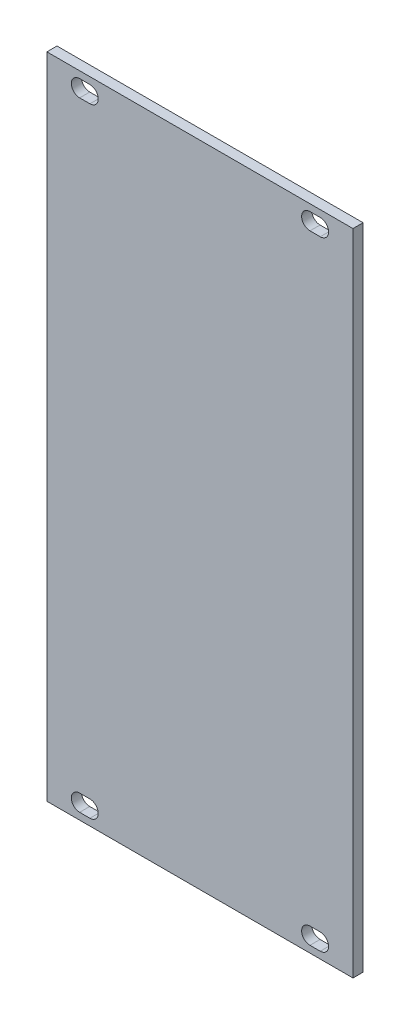
ISO-10303-21;
HEADER;
FILE_DESCRIPTION(('STEP AP214'),'2;1');
FILE_NAME('part.step','',(''),(''),'','','');
FILE_SCHEMA(('AUTOMOTIVE_DESIGN { 1 0 10303 214 1 1 1 1 }'));
ENDSEC;
DATA;
#1=APPLICATION_CONTEXT('core data for automotive mechanical design processes');
#2=APPLICATION_PROTOCOL_DEFINITION('international standard','automotive_design',2000,#1);
#3=PRODUCT_CONTEXT('',#1,'mechanical');
#4=PRODUCT('Part','Part','',(#3));
#5=PRODUCT_RELATED_PRODUCT_CATEGORY('part','',(#4));
#6=PRODUCT_DEFINITION_FORMATION('','',#4);
#7=PRODUCT_DEFINITION_CONTEXT('part definition',#1,'design');
#8=PRODUCT_DEFINITION('design','',#6,#7);
#9=PRODUCT_DEFINITION_SHAPE('','',#8);
#10=(LENGTH_UNIT() NAMED_UNIT(*) SI_UNIT(.MILLI.,.METRE.));
#11=(NAMED_UNIT(*) PLANE_ANGLE_UNIT() SI_UNIT($,.RADIAN.));
#12=(NAMED_UNIT(*) SI_UNIT($,.STERADIAN.) SOLID_ANGLE_UNIT());
#13=UNCERTAINTY_MEASURE_WITH_UNIT(LENGTH_MEASURE(1.E-05),#10,'distance_accuracy_value','');
#14=(GEOMETRIC_REPRESENTATION_CONTEXT(3) GLOBAL_UNCERTAINTY_ASSIGNED_CONTEXT((#13)) GLOBAL_UNIT_ASSIGNED_CONTEXT((#10,
#11,#12)) REPRESENTATION_CONTEXT('',''));
#15=CARTESIAN_POINT('',(0.,0.,0.));
#16=DIRECTION('',(0.,0.,1.));
#17=DIRECTION('',(1.,0.,0.));
#18=AXIS2_PLACEMENT_3D('',#15,#16,#17);
#19=CARTESIAN_POINT('',(0.,0.,2.));
#20=DIRECTION('',(0.,0.,1.));
#21=DIRECTION('',(1.,0.,0.));
#22=AXIS2_PLACEMENT_3D('',#19,#20,#21);
#23=PLANE('',#22);
#24=DIRECTION('',(0.,1.,0.));
#25=VECTOR('',#24,1.);
#26=CARTESIAN_POINT('',(30.3,64.25,2.));
#27=LINE('',#26,#25);
#28=CARTESIAN_POINT('',(30.3,-64.25,2.));
#29=VERTEX_POINT('',#28);
#30=CARTESIAN_POINT('',(30.3,64.25,2.));
#31=VERTEX_POINT('',#30);
#32=EDGE_CURVE('E360',#29,#31,#27,.T.);
#33=ORIENTED_EDGE('',*,*,#32,.T.);
#34=DIRECTION('',(-1.,0.,0.));
#35=VECTOR('',#34,1.);
#36=CARTESIAN_POINT('',(-30.3,64.25,2.));
#37=LINE('',#36,#35);
#38=CARTESIAN_POINT('',(-30.3,64.25,2.));
#39=VERTEX_POINT('',#38);
#40=EDGE_CURVE('E364',#31,#39,#37,.T.);
#41=ORIENTED_EDGE('',*,*,#40,.T.);
#42=DIRECTION('',(0.,-1.,0.));
#43=VECTOR('',#42,1.);
#44=CARTESIAN_POINT('',(-30.3,64.25,2.));
#45=LINE('',#44,#43);
#46=CARTESIAN_POINT('',(-30.3,-64.25,2.));
#47=VERTEX_POINT('',#46);
#48=EDGE_CURVE('E368',#39,#47,#45,.T.);
#49=ORIENTED_EDGE('',*,*,#48,.T.);
#50=DIRECTION('',(1.,0.,0.));
#51=VECTOR('',#50,1.);
#52=CARTESIAN_POINT('',(-30.3,-64.25,2.));
#53=LINE('',#52,#51);
#54=EDGE_CURVE('E371',#47,#29,#53,.T.);
#55=ORIENTED_EDGE('',*,*,#54,.T.);
#56=EDGE_LOOP('',(#33,#41,#49,#55));
#57=FACE_BOUND('',#56,.T.);
#58=DIRECTION('',(1.,0.,0.));
#59=VECTOR('',#58,1.);
#60=CARTESIAN_POINT('',(-23.816,-62.9,2.));
#61=LINE('',#60,#59);
#62=CARTESIAN_POINT('',(-23.816,-62.9,2.));
#63=VERTEX_POINT('',#62);
#64=CARTESIAN_POINT('',(-21.784,-62.9,2.));
#65=VERTEX_POINT('',#64);
#66=EDGE_CURVE('E320',#63,#65,#61,.T.);
#67=ORIENTED_EDGE('',*,*,#66,.F.);
#68=CARTESIAN_POINT('',(-23.816,-61.25,2.));
#69=DIRECTION('',(0.,0.,1.));
#70=DIRECTION('',(1.,0.,0.));
#71=AXIS2_PLACEMENT_3D('',#68,#69,#70);
#72=CIRCLE('',#71,1.65);
#73=CARTESIAN_POINT('',(-23.816,-59.6,2.));
#74=VERTEX_POINT('',#73);
#75=EDGE_CURVE('E317',#74,#63,#72,.T.);
#76=ORIENTED_EDGE('',*,*,#75,.F.);
#77=DIRECTION('',(-1.,0.,0.));
#78=VECTOR('',#77,1.);
#79=CARTESIAN_POINT('',(-23.816,-59.6,2.));
#80=LINE('',#79,#78);
#81=CARTESIAN_POINT('',(-21.784,-59.6,2.));
#82=VERTEX_POINT('',#81);
#83=EDGE_CURVE('E328',#82,#74,#80,.T.);
#84=ORIENTED_EDGE('',*,*,#83,.F.);
#85=CARTESIAN_POINT('',(-21.784,-61.25,2.));
#86=DIRECTION('',(0.,0.,1.));
#87=DIRECTION('',(1.,0.,0.));
#88=AXIS2_PLACEMENT_3D('',#85,#86,#87);
#89=CIRCLE('',#88,1.65);
#90=EDGE_CURVE('E324',#65,#82,#89,.T.);
#91=ORIENTED_EDGE('',*,*,#90,.F.);
#92=EDGE_LOOP('',(#67,#76,#84,#91));
#93=FACE_BOUND('',#92,.T.);
#94=DIRECTION('',(1.,0.,0.));
#95=VECTOR('',#94,1.);
#96=CARTESIAN_POINT('',(21.784000014,59.6,2.));
#97=LINE('',#96,#95);
#98=CARTESIAN_POINT('',(21.784000014,59.6,2.));
#99=VERTEX_POINT('',#98);
#100=CARTESIAN_POINT('',(23.816000014,59.6,2.));
#101=VERTEX_POINT('',#100);
#102=EDGE_CURVE('E277',#99,#101,#97,.T.);
#103=ORIENTED_EDGE('',*,*,#102,.F.);
#104=CARTESIAN_POINT('',(21.784000014,61.25,2.));
#105=DIRECTION('',(0.,0.,1.));
#106=DIRECTION('',(1.,0.,0.));
#107=AXIS2_PLACEMENT_3D('',#104,#105,#106);
#108=CIRCLE('',#107,1.65000000000001);
#109=CARTESIAN_POINT('',(21.784000014,62.9,2.));
#110=VERTEX_POINT('',#109);
#111=EDGE_CURVE('E274',#110,#99,#108,.T.);
#112=ORIENTED_EDGE('',*,*,#111,.F.);
#113=DIRECTION('',(-1.,0.,0.));
#114=VECTOR('',#113,1.);
#115=CARTESIAN_POINT('',(21.784000014,62.9,2.));
#116=LINE('',#115,#114);
#117=CARTESIAN_POINT('',(23.816000014,62.9,2.));
#118=VERTEX_POINT('',#117);
#119=EDGE_CURVE('E285',#118,#110,#116,.T.);
#120=ORIENTED_EDGE('',*,*,#119,.F.);
#121=CARTESIAN_POINT('',(23.816000014,61.25,2.));
#122=DIRECTION('',(0.,0.,1.));
#123=DIRECTION('',(1.,0.,0.));
#124=AXIS2_PLACEMENT_3D('',#121,#122,#123);
#125=CIRCLE('',#124,1.65000000000001);
#126=EDGE_CURVE('E281',#101,#118,#125,.T.);
#127=ORIENTED_EDGE('',*,*,#126,.F.);
#128=EDGE_LOOP('',(#103,#112,#120,#127));
#129=FACE_BOUND('',#128,.T.);
#130=DIRECTION('',(1.,0.,0.));
#131=VECTOR('',#130,1.);
#132=CARTESIAN_POINT('',(-23.816,59.6,2.));
#133=LINE('',#132,#131);
#134=CARTESIAN_POINT('',(-23.816,59.6,2.));
#135=VERTEX_POINT('',#134);
#136=CARTESIAN_POINT('',(-21.784,59.6,2.));
#137=VERTEX_POINT('',#136);
#138=EDGE_CURVE('E234',#135,#137,#133,.T.);
#139=ORIENTED_EDGE('',*,*,#138,.F.);
#140=CARTESIAN_POINT('',(-23.816,61.25,2.));
#141=DIRECTION('',(0.,0.,1.));
#142=DIRECTION('',(1.,0.,0.));
#143=AXIS2_PLACEMENT_3D('',#140,#141,#142);
#144=CIRCLE('',#143,1.64999999999999);
#145=CARTESIAN_POINT('',(-23.816,62.9,2.));
#146=VERTEX_POINT('',#145);
#147=EDGE_CURVE('E231',#146,#135,#144,.T.);
#148=ORIENTED_EDGE('',*,*,#147,.F.);
#149=DIRECTION('',(-1.,0.,0.));
#150=VECTOR('',#149,1.);
#151=CARTESIAN_POINT('',(-23.816,62.9,2.));
#152=LINE('',#151,#150);
#153=CARTESIAN_POINT('',(-21.784,62.9,2.));
#154=VERTEX_POINT('',#153);
#155=EDGE_CURVE('E242',#154,#146,#152,.T.);
#156=ORIENTED_EDGE('',*,*,#155,.F.);
#157=CARTESIAN_POINT('',(-21.784,61.25,2.));
#158=DIRECTION('',(0.,0.,1.));
#159=DIRECTION('',(1.,0.,0.));
#160=AXIS2_PLACEMENT_3D('',#157,#158,#159);
#161=CIRCLE('',#160,1.64999999999999);
#162=EDGE_CURVE('E238',#137,#154,#161,.T.);
#163=ORIENTED_EDGE('',*,*,#162,.F.);
#164=EDGE_LOOP('',(#139,#148,#156,#163));
#165=FACE_BOUND('',#164,.T.);
#166=DIRECTION('',(1.,0.,0.));
#167=VECTOR('',#166,1.);
#168=CARTESIAN_POINT('',(21.784000014,-62.9,2.));
#169=LINE('',#168,#167);
#170=CARTESIAN_POINT('',(21.784000014,-62.9,2.));
#171=VERTEX_POINT('',#170);
#172=CARTESIAN_POINT('',(23.816000014,-62.9,2.));
#173=VERTEX_POINT('',#172);
#174=EDGE_CURVE('E192',#171,#173,#169,.T.);
#175=ORIENTED_EDGE('',*,*,#174,.F.);
#176=CARTESIAN_POINT('',(21.784000014,-61.25,2.));
#177=DIRECTION('',(0.,0.,1.));
#178=DIRECTION('',(1.,0.,0.));
#179=AXIS2_PLACEMENT_3D('',#176,#177,#178);
#180=CIRCLE('',#179,1.65);
#181=CARTESIAN_POINT('',(21.784000014,-59.6,2.));
#182=VERTEX_POINT('',#181);
#183=EDGE_CURVE('E183',#182,#171,#180,.T.);
#184=ORIENTED_EDGE('',*,*,#183,.F.);
#185=DIRECTION('',(-1.,0.,0.));
#186=VECTOR('',#185,1.);
#187=CARTESIAN_POINT('',(21.784000014,-59.6,2.));
#188=LINE('',#187,#186);
#189=CARTESIAN_POINT('',(23.816000014,-59.6,2.));
#190=VERTEX_POINT('',#189);
#191=EDGE_CURVE('E209',#190,#182,#188,.T.);
#192=ORIENTED_EDGE('',*,*,#191,.F.);
#193=CARTESIAN_POINT('',(23.816000014,-61.25,2.));
#194=DIRECTION('',(0.,0.,1.));
#195=DIRECTION('',(1.,0.,0.));
#196=AXIS2_PLACEMENT_3D('',#193,#194,#195);
#197=CIRCLE('',#196,1.65);
#198=EDGE_CURVE('E205',#173,#190,#197,.T.);
#199=ORIENTED_EDGE('',*,*,#198,.F.);
#200=EDGE_LOOP('',(#175,#184,#192,#199));
#201=FACE_BOUND('',#200,.T.);
#202=ADVANCED_FACE('F45',(#57,#93,#129,#165,#201),#23,.T.);
#203=CARTESIAN_POINT('',(0.,0.,0.));
#204=DIRECTION('',(0.,0.,1.));
#205=DIRECTION('',(1.,0.,0.));
#206=AXIS2_PLACEMENT_3D('',#203,#204,#205);
#207=PLANE('',#206);
#208=CARTESIAN_POINT('',(-23.816,61.25,0.));
#209=DIRECTION('',(0.,0.,1.));
#210=DIRECTION('',(1.,0.,0.));
#211=AXIS2_PLACEMENT_3D('',#208,#209,#210);
#212=CIRCLE('',#211,1.64999999999999);
#213=CARTESIAN_POINT('',(-23.816,62.9,0.));
#214=VERTEX_POINT('',#213);
#215=CARTESIAN_POINT('',(-23.816,59.6,0.));
#216=VERTEX_POINT('',#215);
#217=EDGE_CURVE('E201',#214,#216,#212,.T.);
#218=ORIENTED_EDGE('',*,*,#217,.T.);
#219=DIRECTION('',(1.,0.,0.));
#220=VECTOR('',#219,1.);
#221=CARTESIAN_POINT('',(-23.816,59.6,0.));
#222=LINE('',#221,#220);
#223=CARTESIAN_POINT('',(-21.784,59.6,0.));
#224=VERTEX_POINT('',#223);
#225=EDGE_CURVE('E249',#216,#224,#222,.T.);
#226=ORIENTED_EDGE('',*,*,#225,.T.);
#227=CARTESIAN_POINT('',(-21.784,61.25,0.));
#228=DIRECTION('',(0.,0.,1.));
#229=DIRECTION('',(1.,0.,0.));
#230=AXIS2_PLACEMENT_3D('',#227,#228,#229);
#231=CIRCLE('',#230,1.64999999999999);
#232=CARTESIAN_POINT('',(-21.784,62.9,0.));
#233=VERTEX_POINT('',#232);
#234=EDGE_CURVE('E253',#224,#233,#231,.T.);
#235=ORIENTED_EDGE('',*,*,#234,.T.);
#236=DIRECTION('',(-1.,0.,0.));
#237=VECTOR('',#236,1.);
#238=CARTESIAN_POINT('',(-23.816,62.9,0.));
#239=LINE('',#238,#237);
#240=EDGE_CURVE('E235',#233,#214,#239,.T.);
#241=ORIENTED_EDGE('',*,*,#240,.T.);
#242=EDGE_LOOP('',(#218,#226,#235,#241));
#243=FACE_BOUND('',#242,.T.);
#244=CARTESIAN_POINT('',(-23.816,-61.25,0.));
#245=DIRECTION('',(0.,0.,1.));
#246=DIRECTION('',(1.,0.,0.));
#247=AXIS2_PLACEMENT_3D('',#244,#245,#246);
#248=CIRCLE('',#247,1.65);
#249=CARTESIAN_POINT('',(-23.816,-59.6,0.));
#250=VERTEX_POINT('',#249);
#251=CARTESIAN_POINT('',(-23.816,-62.9,0.));
#252=VERTEX_POINT('',#251);
#253=EDGE_CURVE('E316',#250,#252,#248,.T.);
#254=ORIENTED_EDGE('',*,*,#253,.T.);
#255=DIRECTION('',(1.,0.,0.));
#256=VECTOR('',#255,1.);
#257=CARTESIAN_POINT('',(-23.816,-62.9,0.));
#258=LINE('',#257,#256);
#259=CARTESIAN_POINT('',(-21.784,-62.9,0.));
#260=VERTEX_POINT('',#259);
#261=EDGE_CURVE('E335',#252,#260,#258,.T.);
#262=ORIENTED_EDGE('',*,*,#261,.T.);
#263=CARTESIAN_POINT('',(-21.784,-61.25,0.));
#264=DIRECTION('',(0.,0.,1.));
#265=DIRECTION('',(1.,0.,0.));
#266=AXIS2_PLACEMENT_3D('',#263,#264,#265);
#267=CIRCLE('',#266,1.65);
#268=CARTESIAN_POINT('',(-21.784,-59.6,0.));
#269=VERTEX_POINT('',#268);
#270=EDGE_CURVE('E339',#260,#269,#267,.T.);
#271=ORIENTED_EDGE('',*,*,#270,.T.);
#272=DIRECTION('',(-1.,0.,0.));
#273=VECTOR('',#272,1.);
#274=CARTESIAN_POINT('',(-23.816,-59.6,0.));
#275=LINE('',#274,#273);
#276=EDGE_CURVE('E321',#269,#250,#275,.T.);
#277=ORIENTED_EDGE('',*,*,#276,.T.);
#278=EDGE_LOOP('',(#254,#262,#271,#277));
#279=FACE_BOUND('',#278,.T.);
#280=DIRECTION('',(0.,1.,0.));
#281=VECTOR('',#280,1.);
#282=CARTESIAN_POINT('',(30.3,64.25,0.));
#283=LINE('',#282,#281);
#284=CARTESIAN_POINT('',(30.3,-64.25,0.));
#285=VERTEX_POINT('',#284);
#286=CARTESIAN_POINT('',(30.3,64.25,0.));
#287=VERTEX_POINT('',#286);
#288=EDGE_CURVE('E359',#285,#287,#283,.T.);
#289=ORIENTED_EDGE('',*,*,#288,.F.);
#290=DIRECTION('',(1.,0.,0.));
#291=VECTOR('',#290,1.);
#292=CARTESIAN_POINT('',(-30.3,-64.25,0.));
#293=LINE('',#292,#291);
#294=CARTESIAN_POINT('',(-30.3,-64.25,0.));
#295=VERTEX_POINT('',#294);
#296=EDGE_CURVE('E365',#295,#285,#293,.T.);
#297=ORIENTED_EDGE('',*,*,#296,.F.);
#298=DIRECTION('',(0.,-1.,0.));
#299=VECTOR('',#298,1.);
#300=CARTESIAN_POINT('',(-30.3,64.25,0.));
#301=LINE('',#300,#299);
#302=CARTESIAN_POINT('',(-30.3,64.25,0.));
#303=VERTEX_POINT('',#302);
#304=EDGE_CURVE('E381',#303,#295,#301,.T.);
#305=ORIENTED_EDGE('',*,*,#304,.F.);
#306=DIRECTION('',(-1.,0.,0.));
#307=VECTOR('',#306,1.);
#308=CARTESIAN_POINT('',(-30.3,64.25,0.));
#309=LINE('',#308,#307);
#310=EDGE_CURVE('E378',#287,#303,#309,.T.);
#311=ORIENTED_EDGE('',*,*,#310,.F.);
#312=EDGE_LOOP('',(#289,#297,#305,#311));
#313=FACE_BOUND('',#312,.T.);
#314=CARTESIAN_POINT('',(21.784000014,61.25,0.));
#315=DIRECTION('',(0.,0.,1.));
#316=DIRECTION('',(1.,0.,0.));
#317=AXIS2_PLACEMENT_3D('',#314,#315,#316);
#318=CIRCLE('',#317,1.65000000000001);
#319=CARTESIAN_POINT('',(21.784000014,62.9,0.));
#320=VERTEX_POINT('',#319);
#321=CARTESIAN_POINT('',(21.784000014,59.6,0.));
#322=VERTEX_POINT('',#321);
#323=EDGE_CURVE('E273',#320,#322,#318,.T.);
#324=ORIENTED_EDGE('',*,*,#323,.T.);
#325=DIRECTION('',(1.,0.,0.));
#326=VECTOR('',#325,1.);
#327=CARTESIAN_POINT('',(21.784000014,59.6,0.));
#328=LINE('',#327,#326);
#329=CARTESIAN_POINT('',(23.816000014,59.6,0.));
#330=VERTEX_POINT('',#329);
#331=EDGE_CURVE('E292',#322,#330,#328,.T.);
#332=ORIENTED_EDGE('',*,*,#331,.T.);
#333=CARTESIAN_POINT('',(23.816000014,61.25,0.));
#334=DIRECTION('',(0.,0.,1.));
#335=DIRECTION('',(1.,0.,0.));
#336=AXIS2_PLACEMENT_3D('',#333,#334,#335);
#337=CIRCLE('',#336,1.65000000000001);
#338=CARTESIAN_POINT('',(23.816000014,62.9,0.));
#339=VERTEX_POINT('',#338);
#340=EDGE_CURVE('E296',#330,#339,#337,.T.);
#341=ORIENTED_EDGE('',*,*,#340,.T.);
#342=DIRECTION('',(-1.,0.,0.));
#343=VECTOR('',#342,1.);
#344=CARTESIAN_POINT('',(21.784000014,62.9,0.));
#345=LINE('',#344,#343);
#346=EDGE_CURVE('E278',#339,#320,#345,.T.);
#347=ORIENTED_EDGE('',*,*,#346,.T.);
#348=EDGE_LOOP('',(#324,#332,#341,#347));
#349=FACE_BOUND('',#348,.T.);
#350=CARTESIAN_POINT('',(21.784000014,-61.25,0.));
#351=DIRECTION('',(0.,0.,1.));
#352=DIRECTION('',(1.,0.,0.));
#353=AXIS2_PLACEMENT_3D('',#350,#351,#352);
#354=CIRCLE('',#353,1.65);
#355=CARTESIAN_POINT('',(21.784000014,-59.6,0.));
#356=VERTEX_POINT('',#355);
#357=CARTESIAN_POINT('',(21.784000014,-62.9,0.));
#358=VERTEX_POINT('',#357);
#359=EDGE_CURVE('E69',#356,#358,#354,.T.);
#360=ORIENTED_EDGE('',*,*,#359,.T.);
#361=DIRECTION('',(1.,0.,0.));
#362=VECTOR('',#361,1.);
#363=CARTESIAN_POINT('',(21.784000014,-62.9,0.));
#364=LINE('',#363,#362);
#365=CARTESIAN_POINT('',(23.816000014,-62.9,0.));
#366=VERTEX_POINT('',#365);
#367=EDGE_CURVE('E199',#358,#366,#364,.T.);
#368=ORIENTED_EDGE('',*,*,#367,.T.);
#369=CARTESIAN_POINT('',(23.816000014,-61.25,0.));
#370=DIRECTION('',(0.,0.,1.));
#371=DIRECTION('',(1.,0.,0.));
#372=AXIS2_PLACEMENT_3D('',#369,#370,#371);
#373=CIRCLE('',#372,1.65);
#374=CARTESIAN_POINT('',(23.816000014,-59.6,0.));
#375=VERTEX_POINT('',#374);
#376=EDGE_CURVE('E218',#366,#375,#373,.T.);
#377=ORIENTED_EDGE('',*,*,#376,.T.);
#378=DIRECTION('',(-1.,0.,0.));
#379=VECTOR('',#378,1.);
#380=CARTESIAN_POINT('',(21.784000014,-59.6,0.));
#381=LINE('',#380,#379);
#382=EDGE_CURVE('E193',#375,#356,#381,.T.);
#383=ORIENTED_EDGE('',*,*,#382,.T.);
#384=EDGE_LOOP('',(#360,#368,#377,#383));
#385=FACE_BOUND('',#384,.T.);
#386=ADVANCED_FACE('F404',(#243,#279,#313,#349,#385),#207,.F.);
#387=CARTESIAN_POINT('',(30.3,64.25,2.));
#388=DIRECTION('',(-1.,0.,0.));
#389=DIRECTION('',(0.,-1.,0.));
#390=AXIS2_PLACEMENT_3D('',#387,#388,#389);
#391=PLANE('',#390);
#392=ORIENTED_EDGE('',*,*,#288,.T.);
#393=DIRECTION('',(0.,0.,-1.));
#394=VECTOR('',#393,1.);
#395=CARTESIAN_POINT('',(30.3,64.25,2.));
#396=LINE('',#395,#394);
#397=EDGE_CURVE('E11',#31,#287,#396,.T.);
#398=ORIENTED_EDGE('',*,*,#397,.F.);
#399=ORIENTED_EDGE('',*,*,#32,.F.);
#400=DIRECTION('',(0.,0.,-1.));
#401=VECTOR('',#400,1.);
#402=CARTESIAN_POINT('',(30.3,-64.25,2.));
#403=LINE('',#402,#401);
#404=EDGE_CURVE('E374',#29,#285,#403,.T.);
#405=ORIENTED_EDGE('',*,*,#404,.T.);
#406=EDGE_LOOP('',(#392,#398,#399,#405));
#407=FACE_BOUND('',#406,.T.);
#408=ADVANCED_FACE('F47',(#407),#391,.F.);
#409=CARTESIAN_POINT('',(-30.3,64.25,2.));
#410=DIRECTION('',(0.,-1.,0.));
#411=DIRECTION('',(0.,0.,-1.));
#412=AXIS2_PLACEMENT_3D('',#409,#410,#411);
#413=PLANE('',#412);
#414=ORIENTED_EDGE('',*,*,#310,.T.);
#415=DIRECTION('',(0.,0.,-1.));
#416=VECTOR('',#415,1.);
#417=CARTESIAN_POINT('',(-30.3,64.25,2.));
#418=LINE('',#417,#416);
#419=EDGE_CURVE('E54',#39,#303,#418,.T.);
#420=ORIENTED_EDGE('',*,*,#419,.F.);
#421=ORIENTED_EDGE('',*,*,#40,.F.);
#422=ORIENTED_EDGE('',*,*,#397,.T.);
#423=EDGE_LOOP('',(#414,#420,#421,#422));
#424=FACE_BOUND('',#423,.T.);
#425=ADVANCED_FACE('F415',(#424),#413,.F.);
#426=CARTESIAN_POINT('',(-30.3,64.25,2.));
#427=DIRECTION('',(1.,0.,0.));
#428=DIRECTION('',(0.,1.,0.));
#429=AXIS2_PLACEMENT_3D('',#426,#427,#428);
#430=PLANE('',#429);
#431=ORIENTED_EDGE('',*,*,#304,.T.);
#432=DIRECTION('',(0.,0.,-1.));
#433=VECTOR('',#432,1.);
#434=CARTESIAN_POINT('',(-30.3,-64.25,2.));
#435=LINE('',#434,#433);
#436=EDGE_CURVE('E389',#47,#295,#435,.T.);
#437=ORIENTED_EDGE('',*,*,#436,.F.);
#438=ORIENTED_EDGE('',*,*,#48,.F.);
#439=ORIENTED_EDGE('',*,*,#419,.T.);
#440=EDGE_LOOP('',(#431,#437,#438,#439));
#441=FACE_BOUND('',#440,.T.);
#442=ADVANCED_FACE('F398',(#441),#430,.F.);
#443=CARTESIAN_POINT('',(-30.3,-64.25,2.));
#444=DIRECTION('',(0.,1.,0.));
#445=DIRECTION('',(-1.,0.,0.));
#446=AXIS2_PLACEMENT_3D('',#443,#444,#445);
#447=PLANE('',#446);
#448=ORIENTED_EDGE('',*,*,#296,.T.);
#449=ORIENTED_EDGE('',*,*,#404,.F.);
#450=ORIENTED_EDGE('',*,*,#54,.F.);
#451=ORIENTED_EDGE('',*,*,#436,.T.);
#452=EDGE_LOOP('',(#448,#449,#450,#451));
#453=FACE_BOUND('',#452,.T.);
#454=ADVANCED_FACE('F408',(#453),#447,.F.);
#455=CARTESIAN_POINT('',(-23.816,-61.25,2.));
#456=DIRECTION('',(0.,0.,-1.));
#457=DIRECTION('',(-1.,0.,0.));
#458=AXIS2_PLACEMENT_3D('',#455,#456,#457);
#459=CYLINDRICAL_SURFACE('',#458,1.65);
#460=ORIENTED_EDGE('',*,*,#253,.F.);
#461=DIRECTION('',(0.,0.,-1.));
#462=VECTOR('',#461,1.);
#463=CARTESIAN_POINT('',(-23.816,-59.6,2.));
#464=LINE('',#463,#462);
#465=EDGE_CURVE('E331',#74,#250,#464,.T.);
#466=ORIENTED_EDGE('',*,*,#465,.F.);
#467=ORIENTED_EDGE('',*,*,#75,.T.);
#468=DIRECTION('',(0.,0.,-1.));
#469=VECTOR('',#468,1.);
#470=CARTESIAN_POINT('',(-23.816,-62.9,2.));
#471=LINE('',#470,#469);
#472=EDGE_CURVE('E355',#63,#252,#471,.T.);
#473=ORIENTED_EDGE('',*,*,#472,.T.);
#474=EDGE_LOOP('',(#460,#466,#467,#473));
#475=FACE_BOUND('',#474,.T.);
#476=ADVANCED_FACE('F430',(#475),#459,.F.);
#477=CARTESIAN_POINT('',(-23.816,-62.9,2.));
#478=DIRECTION('',(0.,1.,0.));
#479=DIRECTION('',(0.,0.,1.));
#480=AXIS2_PLACEMENT_3D('',#477,#478,#479);
#481=PLANE('',#480);
#482=ORIENTED_EDGE('',*,*,#261,.F.);
#483=ORIENTED_EDGE('',*,*,#472,.F.);
#484=ORIENTED_EDGE('',*,*,#66,.T.);
#485=DIRECTION('',(0.,0.,-1.));
#486=VECTOR('',#485,1.);
#487=CARTESIAN_POINT('',(-21.784,-62.9,2.));
#488=LINE('',#487,#486);
#489=EDGE_CURVE('E352',#65,#260,#488,.T.);
#490=ORIENTED_EDGE('',*,*,#489,.T.);
#491=EDGE_LOOP('',(#482,#483,#484,#490));
#492=FACE_BOUND('',#491,.T.);
#493=ADVANCED_FACE('F437',(#492),#481,.T.);
#494=CARTESIAN_POINT('',(-21.784,-61.25,2.));
#495=DIRECTION('',(0.,0.,-1.));
#496=DIRECTION('',(-1.,0.,0.));
#497=AXIS2_PLACEMENT_3D('',#494,#495,#496);
#498=CYLINDRICAL_SURFACE('',#497,1.65);
#499=ORIENTED_EDGE('',*,*,#270,.F.);
#500=ORIENTED_EDGE('',*,*,#489,.F.);
#501=ORIENTED_EDGE('',*,*,#90,.T.);
#502=DIRECTION('',(0.,0.,-1.));
#503=VECTOR('',#502,1.);
#504=CARTESIAN_POINT('',(-21.784,-59.6,2.));
#505=LINE('',#504,#503);
#506=EDGE_CURVE('E349',#82,#269,#505,.T.);
#507=ORIENTED_EDGE('',*,*,#506,.T.);
#508=EDGE_LOOP('',(#499,#500,#501,#507));
#509=FACE_BOUND('',#508,.T.);
#510=ADVANCED_FACE('F442',(#509),#498,.F.);
#511=CARTESIAN_POINT('',(-23.816,-59.6,2.));
#512=DIRECTION('',(0.,-1.,0.));
#513=DIRECTION('',(0.,0.,-1.));
#514=AXIS2_PLACEMENT_3D('',#511,#512,#513);
#515=PLANE('',#514);
#516=ORIENTED_EDGE('',*,*,#276,.F.);
#517=ORIENTED_EDGE('',*,*,#506,.F.);
#518=ORIENTED_EDGE('',*,*,#83,.T.);
#519=ORIENTED_EDGE('',*,*,#465,.T.);
#520=EDGE_LOOP('',(#516,#517,#518,#519));
#521=FACE_BOUND('',#520,.T.);
#522=ADVANCED_FACE('F450',(#521),#515,.T.);
#523=CARTESIAN_POINT('',(21.784000014,61.25,2.));
#524=DIRECTION('',(0.,0.,-1.));
#525=DIRECTION('',(-1.,0.,0.));
#526=AXIS2_PLACEMENT_3D('',#523,#524,#525);
#527=CYLINDRICAL_SURFACE('',#526,1.65000000000001);
#528=ORIENTED_EDGE('',*,*,#323,.F.);
#529=DIRECTION('',(0.,0.,-1.));
#530=VECTOR('',#529,1.);
#531=CARTESIAN_POINT('',(21.784000014,62.9,2.));
#532=LINE('',#531,#530);
#533=EDGE_CURVE('E288',#110,#320,#532,.T.);
#534=ORIENTED_EDGE('',*,*,#533,.F.);
#535=ORIENTED_EDGE('',*,*,#111,.T.);
#536=DIRECTION('',(0.,0.,-1.));
#537=VECTOR('',#536,1.);
#538=CARTESIAN_POINT('',(21.784000014,59.6,2.));
#539=LINE('',#538,#537);
#540=EDGE_CURVE('E312',#99,#322,#539,.T.);
#541=ORIENTED_EDGE('',*,*,#540,.T.);
#542=EDGE_LOOP('',(#528,#534,#535,#541));
#543=FACE_BOUND('',#542,.T.);
#544=ADVANCED_FACE('F504',(#543),#527,.F.);
#545=CARTESIAN_POINT('',(21.784000014,59.6,2.));
#546=DIRECTION('',(0.,1.,0.));
#547=DIRECTION('',(0.,0.,1.));
#548=AXIS2_PLACEMENT_3D('',#545,#546,#547);
#549=PLANE('',#548);
#550=ORIENTED_EDGE('',*,*,#331,.F.);
#551=ORIENTED_EDGE('',*,*,#540,.F.);
#552=ORIENTED_EDGE('',*,*,#102,.T.);
#553=DIRECTION('',(0.,0.,-1.));
#554=VECTOR('',#553,1.);
#555=CARTESIAN_POINT('',(23.816000014,59.6,2.));
#556=LINE('',#555,#554);
#557=EDGE_CURVE('E309',#101,#330,#556,.T.);
#558=ORIENTED_EDGE('',*,*,#557,.T.);
#559=EDGE_LOOP('',(#550,#551,#552,#558));
#560=FACE_BOUND('',#559,.T.);
#561=ADVANCED_FACE('F500',(#560),#549,.T.);
#562=CARTESIAN_POINT('',(23.816000014,61.25,2.));
#563=DIRECTION('',(0.,0.,-1.));
#564=DIRECTION('',(-1.,0.,0.));
#565=AXIS2_PLACEMENT_3D('',#562,#563,#564);
#566=CYLINDRICAL_SURFACE('',#565,1.65000000000001);
#567=ORIENTED_EDGE('',*,*,#340,.F.);
#568=ORIENTED_EDGE('',*,*,#557,.F.);
#569=ORIENTED_EDGE('',*,*,#126,.T.);
#570=DIRECTION('',(0.,0.,-1.));
#571=VECTOR('',#570,1.);
#572=CARTESIAN_POINT('',(23.816000014,62.9,2.));
#573=LINE('',#572,#571);
#574=EDGE_CURVE('E306',#118,#339,#573,.T.);
#575=ORIENTED_EDGE('',*,*,#574,.T.);
#576=EDGE_LOOP('',(#567,#568,#569,#575));
#577=FACE_BOUND('',#576,.T.);
#578=ADVANCED_FACE('F496',(#577),#566,.F.);
#579=CARTESIAN_POINT('',(21.784000014,62.9,2.));
#580=DIRECTION('',(0.,-1.,0.));
#581=DIRECTION('',(0.,0.,-1.));
#582=AXIS2_PLACEMENT_3D('',#579,#580,#581);
#583=PLANE('',#582);
#584=ORIENTED_EDGE('',*,*,#346,.F.);
#585=ORIENTED_EDGE('',*,*,#574,.F.);
#586=ORIENTED_EDGE('',*,*,#119,.T.);
#587=ORIENTED_EDGE('',*,*,#533,.T.);
#588=EDGE_LOOP('',(#584,#585,#586,#587));
#589=FACE_BOUND('',#588,.T.);
#590=ADVANCED_FACE('F493',(#589),#583,.T.);
#591=CARTESIAN_POINT('',(-23.816,61.25,2.));
#592=DIRECTION('',(0.,0.,-1.));
#593=DIRECTION('',(-1.,0.,0.));
#594=AXIS2_PLACEMENT_3D('',#591,#592,#593);
#595=CYLINDRICAL_SURFACE('',#594,1.64999999999999);
#596=ORIENTED_EDGE('',*,*,#217,.F.);
#597=DIRECTION('',(0.,0.,-1.));
#598=VECTOR('',#597,1.);
#599=CARTESIAN_POINT('',(-23.816,62.9,2.));
#600=LINE('',#599,#598);
#601=EDGE_CURVE('E245',#146,#214,#600,.T.);
#602=ORIENTED_EDGE('',*,*,#601,.F.);
#603=ORIENTED_EDGE('',*,*,#147,.T.);
#604=DIRECTION('',(0.,0.,-1.));
#605=VECTOR('',#604,1.);
#606=CARTESIAN_POINT('',(-23.816,59.6,2.));
#607=LINE('',#606,#605);
#608=EDGE_CURVE('E269',#135,#216,#607,.T.);
#609=ORIENTED_EDGE('',*,*,#608,.T.);
#610=EDGE_LOOP('',(#596,#602,#603,#609));
#611=FACE_BOUND('',#610,.T.);
#612=ADVANCED_FACE('F475',(#611),#595,.F.);
#613=CARTESIAN_POINT('',(-23.816,59.6,2.));
#614=DIRECTION('',(0.,1.,0.));
#615=DIRECTION('',(0.,0.,1.));
#616=AXIS2_PLACEMENT_3D('',#613,#614,#615);
#617=PLANE('',#616);
#618=ORIENTED_EDGE('',*,*,#225,.F.);
#619=ORIENTED_EDGE('',*,*,#608,.F.);
#620=ORIENTED_EDGE('',*,*,#138,.T.);
#621=DIRECTION('',(0.,0.,-1.));
#622=VECTOR('',#621,1.);
#623=CARTESIAN_POINT('',(-21.784,59.6,2.));
#624=LINE('',#623,#622);
#625=EDGE_CURVE('E266',#137,#224,#624,.T.);
#626=ORIENTED_EDGE('',*,*,#625,.T.);
#627=EDGE_LOOP('',(#618,#619,#620,#626));
#628=FACE_BOUND('',#627,.T.);
#629=ADVANCED_FACE('F469',(#628),#617,.T.);
#630=CARTESIAN_POINT('',(-21.784,61.25,2.));
#631=DIRECTION('',(0.,0.,-1.));
#632=DIRECTION('',(-1.,0.,0.));
#633=AXIS2_PLACEMENT_3D('',#630,#631,#632);
#634=CYLINDRICAL_SURFACE('',#633,1.64999999999999);
#635=ORIENTED_EDGE('',*,*,#234,.F.);
#636=ORIENTED_EDGE('',*,*,#625,.F.);
#637=ORIENTED_EDGE('',*,*,#162,.T.);
#638=DIRECTION('',(0.,0.,-1.));
#639=VECTOR('',#638,1.);
#640=CARTESIAN_POINT('',(-21.784,62.9,2.));
#641=LINE('',#640,#639);
#642=EDGE_CURVE('E263',#154,#233,#641,.T.);
#643=ORIENTED_EDGE('',*,*,#642,.T.);
#644=EDGE_LOOP('',(#635,#636,#637,#643));
#645=FACE_BOUND('',#644,.T.);
#646=ADVANCED_FACE('F472',(#645),#634,.F.);
#647=CARTESIAN_POINT('',(-23.816,62.9,2.));
#648=DIRECTION('',(0.,-1.,0.));
#649=DIRECTION('',(0.,0.,-1.));
#650=AXIS2_PLACEMENT_3D('',#647,#648,#649);
#651=PLANE('',#650);
#652=ORIENTED_EDGE('',*,*,#240,.F.);
#653=ORIENTED_EDGE('',*,*,#642,.F.);
#654=ORIENTED_EDGE('',*,*,#155,.T.);
#655=ORIENTED_EDGE('',*,*,#601,.T.);
#656=EDGE_LOOP('',(#652,#653,#654,#655));
#657=FACE_BOUND('',#656,.T.);
#658=ADVANCED_FACE('F478',(#657),#651,.T.);
#659=CARTESIAN_POINT('',(21.784000014,-61.25,2.));
#660=DIRECTION('',(0.,0.,-1.));
#661=DIRECTION('',(-1.,0.,0.));
#662=AXIS2_PLACEMENT_3D('',#659,#660,#661);
#663=CYLINDRICAL_SURFACE('',#662,1.65);
#664=ORIENTED_EDGE('',*,*,#359,.F.);
#665=DIRECTION('',(0.,0.,-1.));
#666=VECTOR('',#665,1.);
#667=CARTESIAN_POINT('',(21.784000014,-59.6,2.));
#668=LINE('',#667,#666);
#669=EDGE_CURVE('E187',#182,#356,#668,.T.);
#670=ORIENTED_EDGE('',*,*,#669,.F.);
#671=ORIENTED_EDGE('',*,*,#183,.T.);
#672=DIRECTION('',(0.,0.,-1.));
#673=VECTOR('',#672,1.);
#674=CARTESIAN_POINT('',(21.784000014,-62.9,2.));
#675=LINE('',#674,#673);
#676=EDGE_CURVE('E186',#171,#358,#675,.T.);
#677=ORIENTED_EDGE('',*,*,#676,.T.);
#678=EDGE_LOOP('',(#664,#670,#671,#677));
#679=FACE_BOUND('',#678,.T.);
#680=ADVANCED_FACE('F185',(#679),#663,.F.);
#681=CARTESIAN_POINT('',(21.784000014,-62.9,2.));
#682=DIRECTION('',(0.,1.,0.));
#683=DIRECTION('',(0.,0.,1.));
#684=AXIS2_PLACEMENT_3D('',#681,#682,#683);
#685=PLANE('',#684);
#686=ORIENTED_EDGE('',*,*,#367,.F.);
#687=ORIENTED_EDGE('',*,*,#676,.F.);
#688=ORIENTED_EDGE('',*,*,#174,.T.);
#689=DIRECTION('',(0.,0.,-1.));
#690=VECTOR('',#689,1.);
#691=CARTESIAN_POINT('',(23.816000014,-62.9,2.));
#692=LINE('',#691,#690);
#693=EDGE_CURVE('E202',#173,#366,#692,.T.);
#694=ORIENTED_EDGE('',*,*,#693,.T.);
#695=EDGE_LOOP('',(#686,#687,#688,#694));
#696=FACE_BOUND('',#695,.T.);
#697=ADVANCED_FACE('F196',(#696),#685,.T.);
#698=CARTESIAN_POINT('',(23.816000014,-61.25,2.));
#699=DIRECTION('',(0.,0.,-1.));
#700=DIRECTION('',(-1.,0.,0.));
#701=AXIS2_PLACEMENT_3D('',#698,#699,#700);
#702=CYLINDRICAL_SURFACE('',#701,1.65);
#703=ORIENTED_EDGE('',*,*,#376,.F.);
#704=ORIENTED_EDGE('',*,*,#693,.F.);
#705=ORIENTED_EDGE('',*,*,#198,.T.);
#706=DIRECTION('',(0.,0.,-1.));
#707=VECTOR('',#706,1.);
#708=CARTESIAN_POINT('',(23.816000014,-59.6,2.));
#709=LINE('',#708,#707);
#710=EDGE_CURVE('E61',#190,#375,#709,.T.);
#711=ORIENTED_EDGE('',*,*,#710,.T.);
#712=EDGE_LOOP('',(#703,#704,#705,#711));
#713=FACE_BOUND('',#712,.T.);
#714=ADVANCED_FACE('F576',(#713),#702,.F.);
#715=CARTESIAN_POINT('',(21.784000014,-59.6,2.));
#716=DIRECTION('',(0.,-1.,0.));
#717=DIRECTION('',(0.,0.,-1.));
#718=AXIS2_PLACEMENT_3D('',#715,#716,#717);
#719=PLANE('',#718);
#720=ORIENTED_EDGE('',*,*,#382,.F.);
#721=ORIENTED_EDGE('',*,*,#710,.F.);
#722=ORIENTED_EDGE('',*,*,#191,.T.);
#723=ORIENTED_EDGE('',*,*,#669,.T.);
#724=EDGE_LOOP('',(#720,#721,#722,#723));
#725=FACE_BOUND('',#724,.T.);
#726=ADVANCED_FACE('F584',(#725),#719,.T.);
#727=CLOSED_SHELL('',(#202,#386,#408,#425,#442,#454,#476,#493,#510,#522,#544,#561,#578,#590,
#612,#629,#646,#658,#680,#697,#714,#726));
#728=MANIFOLD_SOLID_BREP('B2',#727);
#729=ADVANCED_BREP_SHAPE_REPRESENTATION('',(#18,#728),#14);
#730=SHAPE_DEFINITION_REPRESENTATION(#9,#729);
ENDSEC;
END-ISO-10303-21;
